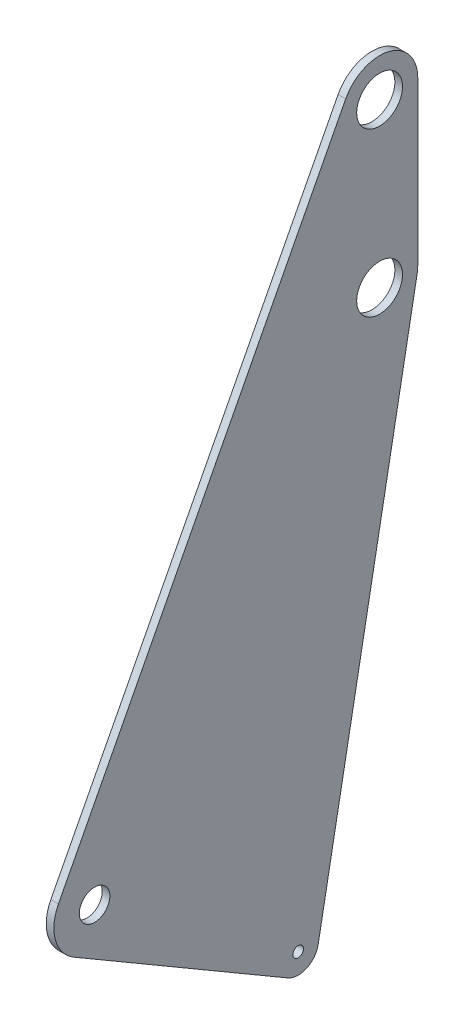
ISO-10303-21;
HEADER;
FILE_DESCRIPTION(('STEP AP214'),'2;1');
FILE_NAME('part.step','',(''),(''),'','','');
FILE_SCHEMA(('AUTOMOTIVE_DESIGN { 1 0 10303 214 1 1 1 1 }'));
ENDSEC;
DATA;
#1=APPLICATION_CONTEXT('core data for automotive mechanical design processes');
#2=APPLICATION_PROTOCOL_DEFINITION('international standard','automotive_design',2000,#1);
#3=PRODUCT_CONTEXT('',#1,'mechanical');
#4=PRODUCT('Part','Part','',(#3));
#5=PRODUCT_RELATED_PRODUCT_CATEGORY('part','',(#4));
#6=PRODUCT_DEFINITION_FORMATION('','',#4);
#7=PRODUCT_DEFINITION_CONTEXT('part definition',#1,'design');
#8=PRODUCT_DEFINITION('design','',#6,#7);
#9=PRODUCT_DEFINITION_SHAPE('','',#8);
#10=(LENGTH_UNIT() NAMED_UNIT(*) SI_UNIT(.MILLI.,.METRE.));
#11=(NAMED_UNIT(*) PLANE_ANGLE_UNIT() SI_UNIT($,.RADIAN.));
#12=(NAMED_UNIT(*) SI_UNIT($,.STERADIAN.) SOLID_ANGLE_UNIT());
#13=UNCERTAINTY_MEASURE_WITH_UNIT(LENGTH_MEASURE(1.E-05),#10,'distance_accuracy_value','');
#14=(GEOMETRIC_REPRESENTATION_CONTEXT(3) GLOBAL_UNCERTAINTY_ASSIGNED_CONTEXT((#13)) GLOBAL_UNIT_ASSIGNED_CONTEXT((#10,
#11,#12)) REPRESENTATION_CONTEXT('',''));
#15=CARTESIAN_POINT('',(0.,0.,0.));
#16=DIRECTION('',(0.,0.,1.));
#17=DIRECTION('',(1.,0.,0.));
#18=AXIS2_PLACEMENT_3D('',#15,#16,#17);
#19=CARTESIAN_POINT('',(0.,12.7,-152.4));
#20=DIRECTION('',(1.,0.,0.));
#21=DIRECTION('',(0.,0.,-1.));
#22=AXIS2_PLACEMENT_3D('',#19,#20,#21);
#23=PLANE('',#22);
#24=CARTESIAN_POINT('',(7.45058528761611E-10,12.7,-152.4));
#25=DIRECTION('',(-1.,0.,0.));
#26=DIRECTION('',(0.,0.,1.));
#27=AXIS2_PLACEMENT_3D('',#24,#25,#26);
#28=CIRCLE('',#27,3.3147);
#29=CARTESIAN_POINT('',(7.45058528761611E-10,12.7,-149.0853));
#30=VERTEX_POINT('',#29);
#31=EDGE_CURVE('E140',#30,#30,#28,.F.);
#32=ORIENTED_EDGE('',*,*,#31,.T.);
#33=EDGE_LOOP('',(#32));
#34=FACE_BOUND('',#33,.T.);
#35=CARTESIAN_POINT('',(7.45058528761611E-10,346.075,-203.2));
#36=DIRECTION('',(-1.,0.,0.));
#37=DIRECTION('',(0.,0.,1.));
#38=AXIS2_PLACEMENT_3D('',#35,#36,#37);
#39=CIRCLE('',#38,14.2875);
#40=CARTESIAN_POINT('',(7.45058528761611E-10,346.075,-188.9125));
#41=VERTEX_POINT('',#40);
#42=EDGE_CURVE('E100',#41,#41,#39,.F.);
#43=ORIENTED_EDGE('',*,*,#42,.T.);
#44=EDGE_LOOP('',(#43));
#45=FACE_BOUND('',#44,.T.);
#46=CARTESIAN_POINT('',(0.,101.6,-25.4));
#47=DIRECTION('',(-1.,0.,0.));
#48=DIRECTION('',(0.,0.,1.));
#49=AXIS2_PLACEMENT_3D('',#46,#47,#48);
#50=CIRCLE('',#49,9.525);
#51=CARTESIAN_POINT('',(0.,101.6,-15.875));
#52=VERTEX_POINT('',#51);
#53=EDGE_CURVE('E143',#52,#52,#50,.F.);
#54=ORIENTED_EDGE('',*,*,#53,.T.);
#55=EDGE_LOOP('',(#54));
#56=FACE_BOUND('',#55,.T.);
#57=CARTESIAN_POINT('',(7.45058528761611E-10,447.675,-203.2));
#58=DIRECTION('',(-1.,0.,0.));
#59=DIRECTION('',(0.,0.,1.));
#60=AXIS2_PLACEMENT_3D('',#57,#58,#59);
#61=CIRCLE('',#60,14.2875);
#62=CARTESIAN_POINT('',(7.45058528761611E-10,447.675,-188.9125));
#63=VERTEX_POINT('',#62);
#64=EDGE_CURVE('E103',#63,#63,#61,.F.);
#65=ORIENTED_EDGE('',*,*,#64,.T.);
#66=EDGE_LOOP('',(#65));
#67=FACE_BOUND('',#66,.T.);
#68=DIRECTION('',(0.,0.50442064043099,0.863458057757984));
#69=VECTOR('',#68,1.);
#70=CARTESIAN_POINT('',(0.,79.6681653329,-12.5877157331));
#71=LINE('',#70,#69);
#72=CARTESIAN_POINT('',(0.,1.73408266647434,-145.99385786639));
#73=VERTEX_POINT('',#72);
#74=CARTESIAN_POINT('',(3.72529264380805E-10,79.6681653329163,-12.5877157330721));
#75=VERTEX_POINT('',#74);
#76=EDGE_CURVE('E83',#73,#75,#71,.T.);
#77=ORIENTED_EDGE('',*,*,#76,.T.);
#78=CARTESIAN_POINT('',(7.45058528761611E-10,101.6,-25.4));
#79=DIRECTION('',(-1.,0.,0.));
#80=DIRECTION('',(0.,0.,1.));
#81=AXIS2_PLACEMENT_3D('',#78,#79,#80);
#82=CIRCLE('',#81,25.4);
#83=CARTESIAN_POINT('',(0.,113.299357351247,-2.85482229904441));
#84=VERTEX_POINT('',#83);
#85=EDGE_CURVE('E148',#84,#75,#82,.F.);
#86=ORIENTED_EDGE('',*,*,#85,.F.);
#87=DIRECTION('',(0.,0.887605421302147,-0.460604620119076));
#88=VECTOR('',#87,1.);
#89=CARTESIAN_POINT('',(0.,113.299357351,-2.85482229892));
#90=LINE('',#89,#88);
#91=CARTESIAN_POINT('',(0.,458.643147516216,-182.063895905269));
#92=VERTEX_POINT('',#91);
#93=EDGE_CURVE('E108',#84,#92,#90,.T.);
#94=ORIENTED_EDGE('',*,*,#93,.T.);
#95=CARTESIAN_POINT('',(0.,447.675,-203.2));
#96=DIRECTION('',(-1.,0.,0.));
#97=DIRECTION('',(0.,0.,1.));
#98=AXIS2_PLACEMENT_3D('',#95,#96,#97);
#99=CIRCLE('',#98,23.8125);
#100=CARTESIAN_POINT('',(0.,447.675,-227.0125));
#101=VERTEX_POINT('',#100);
#102=EDGE_CURVE('E116',#101,#92,#99,.F.);
#103=ORIENTED_EDGE('',*,*,#102,.F.);
#104=DIRECTION('',(0.,1.,0.));
#105=VECTOR('',#104,1.);
#106=CARTESIAN_POINT('',(0.,346.075,-227.0125));
#107=LINE('',#106,#105);
#108=CARTESIAN_POINT('',(0.,346.075,-227.0125));
#109=VERTEX_POINT('',#108);
#110=EDGE_CURVE('E113',#101,#109,#107,.F.);
#111=ORIENTED_EDGE('',*,*,#110,.T.);
#112=CARTESIAN_POINT('',(0.,346.075,-203.2));
#113=DIRECTION('',(-1.,0.,0.));
#114=DIRECTION('',(0.,0.,1.));
#115=AXIS2_PLACEMENT_3D('',#112,#113,#114);
#116=CIRCLE('',#115,23.8125);
#117=CARTESIAN_POINT('',(0.,341.714047226448,-226.609768199343));
#118=VERTEX_POINT('',#117);
#119=EDGE_CURVE('E118',#118,#109,#116,.F.);
#120=ORIENTED_EDGE('',*,*,#119,.F.);
#121=DIRECTION('',(0.,-0.983087378461124,0.183137124337023));
#122=VECTOR('',#121,1.);
#123=CARTESIAN_POINT('',(0.,10.3741585209,-164.885209706));
#124=LINE('',#123,#122);
#125=CARTESIAN_POINT('',(0.,10.374158521089,-164.885209706035));
#126=VERTEX_POINT('',#125);
#127=EDGE_CURVE('E86',#118,#126,#124,.T.);
#128=ORIENTED_EDGE('',*,*,#127,.T.);
#129=CARTESIAN_POINT('',(0.,12.7,-152.4));
#130=DIRECTION('',(-1.,0.,0.));
#131=DIRECTION('',(0.,0.,1.));
#132=AXIS2_PLACEMENT_3D('',#129,#130,#131);
#133=CIRCLE('',#132,12.7);
#134=EDGE_CURVE('E20',#73,#126,#133,.F.);
#135=ORIENTED_EDGE('',*,*,#134,.F.);
#136=EDGE_LOOP('',(#77,#86,#94,#103,#111,#120,#128,#135));
#137=FACE_BOUND('',#136,.T.);
#138=ADVANCED_FACE('F17',(#34,#45,#56,#67,#137),#23,.F.);
#139=CARTESIAN_POINT('',(4.7625,12.7,-152.4));
#140=DIRECTION('',(-1.,0.,0.));
#141=DIRECTION('',(0.,0.,1.));
#142=AXIS2_PLACEMENT_3D('',#139,#140,#141);
#143=CYLINDRICAL_SURFACE('',#142,12.7);
#144=CARTESIAN_POINT('',(4.7625,12.7,-152.4));
#145=DIRECTION('',(-1.,0.,0.));
#146=DIRECTION('',(0.,0.,1.));
#147=AXIS2_PLACEMENT_3D('',#144,#145,#146);
#148=CIRCLE('',#147,12.7);
#149=CARTESIAN_POINT('',(4.7625,1.73408266623929,-145.993857866226));
#150=VERTEX_POINT('',#149);
#151=CARTESIAN_POINT('',(4.7625,10.3741585210012,-164.88520970651));
#152=VERTEX_POINT('',#151);
#153=EDGE_CURVE('E94',#150,#152,#148,.F.);
#154=ORIENTED_EDGE('',*,*,#153,.F.);
#155=DIRECTION('',(1.,0.,0.));
#156=VECTOR('',#155,1.);
#157=CARTESIAN_POINT('',(4.7625,1.73408266653381,-145.993857866289));
#158=LINE('',#157,#156);
#159=EDGE_CURVE('E91',#150,#73,#158,.F.);
#160=ORIENTED_EDGE('',*,*,#159,.T.);
#161=ORIENTED_EDGE('',*,*,#134,.T.);
#162=DIRECTION('',(1.,0.,0.));
#163=VECTOR('',#162,1.);
#164=CARTESIAN_POINT('',(4.7625,10.3741585211767,-164.885209706052));
#165=LINE('',#164,#163);
#166=EDGE_CURVE('E89',#126,#152,#165,.T.);
#167=ORIENTED_EDGE('',*,*,#166,.T.);
#168=EDGE_LOOP('',(#154,#160,#161,#167));
#169=FACE_BOUND('',#168,.T.);
#170=ADVANCED_FACE('F92',(#169),#143,.T.);
#171=CARTESIAN_POINT('',(4.7625,10.3741585209,-164.885209706));
#172=DIRECTION('',(0.,0.183137124337023,0.983087378461124));
#173=DIRECTION('',(0.,-0.983087378461124,0.183137124337023));
#174=AXIS2_PLACEMENT_3D('',#171,#172,#173);
#175=PLANE('',#174);
#176=DIRECTION('',(-1.,0.,0.));
#177=VECTOR('',#176,1.);
#178=CARTESIAN_POINT('',(4.7625,341.714047226095,-226.609768199488));
#179=LINE('',#178,#177);
#180=CARTESIAN_POINT('',(4.7625,341.714047226363,-226.609768199803));
#181=VERTEX_POINT('',#180);
#182=EDGE_CURVE('E151',#181,#118,#179,.T.);
#183=ORIENTED_EDGE('',*,*,#182,.F.);
#184=DIRECTION('',(0.,0.98308737846114,-0.183137124336938));
#185=VECTOR('',#184,1.);
#186=CARTESIAN_POINT('',(4.7625,10.374158521,-164.885209707));
#187=LINE('',#186,#185);
#188=EDGE_CURVE('E138',#152,#181,#187,.T.);
#189=ORIENTED_EDGE('',*,*,#188,.F.);
#190=ORIENTED_EDGE('',*,*,#166,.F.);
#191=ORIENTED_EDGE('',*,*,#127,.F.);
#192=EDGE_LOOP('',(#183,#189,#190,#191));
#193=FACE_BOUND('',#192,.T.);
#194=ADVANCED_FACE('F171',(#193),#175,.F.);
#195=CARTESIAN_POINT('',(4.7625,346.075,-203.2));
#196=DIRECTION('',(-1.,0.,0.));
#197=DIRECTION('',(0.,0.,1.));
#198=AXIS2_PLACEMENT_3D('',#195,#196,#197);
#199=CYLINDRICAL_SURFACE('',#198,23.8125);
#200=CARTESIAN_POINT('',(4.7625,346.075,-203.2));
#201=DIRECTION('',(-1.,0.,0.));
#202=DIRECTION('',(0.,0.,1.));
#203=AXIS2_PLACEMENT_3D('',#200,#201,#202);
#204=CIRCLE('',#203,23.8125);
#205=CARTESIAN_POINT('',(4.7625,346.075,-227.0125000005));
#206=VERTEX_POINT('',#205);
#207=EDGE_CURVE('E135',#181,#206,#204,.F.);
#208=ORIENTED_EDGE('',*,*,#207,.F.);
#209=ORIENTED_EDGE('',*,*,#182,.T.);
#210=ORIENTED_EDGE('',*,*,#119,.T.);
#211=DIRECTION('',(1.,0.,0.));
#212=VECTOR('',#211,1.);
#213=CARTESIAN_POINT('',(4.7625,346.075,-227.0125));
#214=LINE('',#213,#212);
#215=EDGE_CURVE('E117',#109,#206,#214,.T.);
#216=ORIENTED_EDGE('',*,*,#215,.T.);
#217=EDGE_LOOP('',(#208,#209,#210,#216));
#218=FACE_BOUND('',#217,.T.);
#219=ADVANCED_FACE('F172',(#218),#199,.T.);
#220=CARTESIAN_POINT('',(4.7625,346.075,-227.0125));
#221=DIRECTION('',(0.,0.,1.));
#222=DIRECTION('',(1.,0.,0.));
#223=AXIS2_PLACEMENT_3D('',#220,#221,#222);
#224=PLANE('',#223);
#225=DIRECTION('',(-1.,0.,0.));
#226=VECTOR('',#225,1.);
#227=CARTESIAN_POINT('',(4.7625,447.675,-227.0125));
#228=LINE('',#227,#226);
#229=CARTESIAN_POINT('',(4.7625,447.675,-227.0125000005));
#230=VERTEX_POINT('',#229);
#231=EDGE_CURVE('E150',#230,#101,#228,.T.);
#232=ORIENTED_EDGE('',*,*,#231,.F.);
#233=DIRECTION('',(0.,1.,0.));
#234=VECTOR('',#233,1.);
#235=CARTESIAN_POINT('',(4.7625,12.7,-227.012500001));
#236=LINE('',#235,#234);
#237=EDGE_CURVE('E134',#206,#230,#236,.T.);
#238=ORIENTED_EDGE('',*,*,#237,.F.);
#239=ORIENTED_EDGE('',*,*,#215,.F.);
#240=ORIENTED_EDGE('',*,*,#110,.F.);
#241=EDGE_LOOP('',(#232,#238,#239,#240));
#242=FACE_BOUND('',#241,.T.);
#243=ADVANCED_FACE('F177',(#242),#224,.F.);
#244=CARTESIAN_POINT('',(4.7625,447.675,-203.2));
#245=DIRECTION('',(-1.,0.,0.));
#246=DIRECTION('',(0.,0.,1.));
#247=AXIS2_PLACEMENT_3D('',#244,#245,#246);
#248=CYLINDRICAL_SURFACE('',#247,23.8125);
#249=CARTESIAN_POINT('',(4.7625,447.675,-203.2));
#250=DIRECTION('',(-1.,0.,0.));
#251=DIRECTION('',(0.,0.,1.));
#252=AXIS2_PLACEMENT_3D('',#249,#250,#251);
#253=CIRCLE('',#252,23.8125);
#254=CARTESIAN_POINT('',(4.7625,458.643147516276,-182.063895905222));
#255=VERTEX_POINT('',#254);
#256=EDGE_CURVE('E131',#230,#255,#253,.F.);
#257=ORIENTED_EDGE('',*,*,#256,.F.);
#258=ORIENTED_EDGE('',*,*,#231,.T.);
#259=ORIENTED_EDGE('',*,*,#102,.T.);
#260=DIRECTION('',(1.,0.,0.));
#261=VECTOR('',#260,1.);
#262=CARTESIAN_POINT('',(4.7625,458.643147515936,-182.063895905124));
#263=LINE('',#262,#261);
#264=EDGE_CURVE('E112',#92,#255,#263,.T.);
#265=ORIENTED_EDGE('',*,*,#264,.T.);
#266=EDGE_LOOP('',(#257,#258,#259,#265));
#267=FACE_BOUND('',#266,.T.);
#268=ADVANCED_FACE('F181',(#267),#248,.T.);
#269=CARTESIAN_POINT('',(4.7625,113.299357351,-2.85482229892));
#270=DIRECTION('',(0.,-0.460604620119076,-0.887605421302147));
#271=DIRECTION('',(0.,0.887605421302147,-0.460604620119076));
#272=AXIS2_PLACEMENT_3D('',#269,#270,#271);
#273=PLANE('',#272);
#274=DIRECTION('',(-1.,0.,0.));
#275=VECTOR('',#274,1.);
#276=CARTESIAN_POINT('',(4.7625,113.299357351472,-2.85482229915764));
#277=LINE('',#276,#275);
#278=CARTESIAN_POINT('',(4.7625,113.299357351542,-2.85482229854796));
#279=VERTEX_POINT('',#278);
#280=EDGE_CURVE('E111',#279,#84,#277,.T.);
#281=ORIENTED_EDGE('',*,*,#280,.F.);
#282=DIRECTION('',(0.,-0.887605421300947,0.460604620121388));
#283=VECTOR('',#282,1.);
#284=CARTESIAN_POINT('',(4.7625,458.643147516,-182.063895905));
#285=LINE('',#284,#283);
#286=EDGE_CURVE('E130',#255,#279,#285,.T.);
#287=ORIENTED_EDGE('',*,*,#286,.F.);
#288=ORIENTED_EDGE('',*,*,#264,.F.);
#289=ORIENTED_EDGE('',*,*,#93,.F.);
#290=EDGE_LOOP('',(#281,#287,#288,#289));
#291=FACE_BOUND('',#290,.T.);
#292=ADVANCED_FACE('F185',(#291),#273,.F.);
#293=CARTESIAN_POINT('',(4.7625,101.6,-25.4));
#294=DIRECTION('',(-1.,0.,0.));
#295=DIRECTION('',(0.,0.,1.));
#296=AXIS2_PLACEMENT_3D('',#293,#294,#295);
#297=CYLINDRICAL_SURFACE('',#296,25.4);
#298=ORIENTED_EDGE('',*,*,#85,.T.);
#299=DIRECTION('',(1.,0.,0.));
#300=VECTOR('',#299,1.);
#301=CARTESIAN_POINT('',(4.7625,79.6681653329,-12.5877157331));
#302=LINE('',#301,#300);
#303=CARTESIAN_POINT('',(4.7625,79.66816533294,-12.5877157330315));
#304=VERTEX_POINT('',#303);
#305=EDGE_CURVE('E97',#75,#304,#302,.T.);
#306=ORIENTED_EDGE('',*,*,#305,.T.);
#307=CARTESIAN_POINT('',(4.7625,101.6,-25.4));
#308=DIRECTION('',(-1.,0.,0.));
#309=DIRECTION('',(0.,0.,1.));
#310=AXIS2_PLACEMENT_3D('',#307,#308,#309);
#311=CIRCLE('',#310,25.4);
#312=EDGE_CURVE('E35',#279,#304,#311,.F.);
#313=ORIENTED_EDGE('',*,*,#312,.F.);
#314=ORIENTED_EDGE('',*,*,#280,.T.);
#315=EDGE_LOOP('',(#298,#306,#313,#314));
#316=FACE_BOUND('',#315,.T.);
#317=ADVANCED_FACE('F187',(#316),#297,.T.);
#318=CARTESIAN_POINT('',(4.7625,79.6681653329,-12.5877157331));
#319=DIRECTION('',(0.,0.863458057757984,-0.50442064043099));
#320=DIRECTION('',(0.,0.50442064043099,0.863458057757984));
#321=AXIS2_PLACEMENT_3D('',#318,#319,#320);
#322=PLANE('',#321);
#323=ORIENTED_EDGE('',*,*,#159,.F.);
#324=DIRECTION('',(0.,-0.504420640434187,-0.863458057756116));
#325=VECTOR('',#324,1.);
#326=CARTESIAN_POINT('',(4.7625,79.6681653329,-12.5877157331));
#327=LINE('',#326,#325);
#328=EDGE_CURVE('E128',#304,#150,#327,.T.);
#329=ORIENTED_EDGE('',*,*,#328,.F.);
#330=ORIENTED_EDGE('',*,*,#305,.F.);
#331=ORIENTED_EDGE('',*,*,#76,.F.);
#332=EDGE_LOOP('',(#323,#329,#330,#331));
#333=FACE_BOUND('',#332,.T.);
#334=ADVANCED_FACE('F99',(#333),#322,.F.);
#335=CARTESIAN_POINT('',(4.7625,346.075,-203.2));
#336=DIRECTION('',(-1.,0.,0.));
#337=DIRECTION('',(0.,0.,1.));
#338=AXIS2_PLACEMENT_3D('',#335,#336,#337);
#339=CYLINDRICAL_SURFACE('',#338,14.2875);
#340=CARTESIAN_POINT('',(4.7625,346.075,-203.2));
#341=DIRECTION('',(-1.,0.,0.));
#342=DIRECTION('',(0.,0.,1.));
#343=AXIS2_PLACEMENT_3D('',#340,#341,#342);
#344=CIRCLE('',#343,14.2875);
#345=CARTESIAN_POINT('',(4.7625,346.075,-188.9125));
#346=VERTEX_POINT('',#345);
#347=EDGE_CURVE('E125',#346,#346,#344,.T.);
#348=ORIENTED_EDGE('',*,*,#347,.F.);
#349=EDGE_LOOP('',(#348));
#350=FACE_BOUND('',#349,.T.);
#351=ORIENTED_EDGE('',*,*,#42,.F.);
#352=EDGE_LOOP('',(#351));
#353=FACE_BOUND('',#352,.T.);
#354=ADVANCED_FACE('F195',(#350,#353),#339,.F.);
#355=CARTESIAN_POINT('',(4.7625,447.675,-203.2));
#356=DIRECTION('',(-1.,0.,0.));
#357=DIRECTION('',(0.,0.,1.));
#358=AXIS2_PLACEMENT_3D('',#355,#356,#357);
#359=CYLINDRICAL_SURFACE('',#358,14.2875);
#360=CARTESIAN_POINT('',(4.7625,447.675,-203.2));
#361=DIRECTION('',(-1.,0.,0.));
#362=DIRECTION('',(0.,0.,1.));
#363=AXIS2_PLACEMENT_3D('',#360,#361,#362);
#364=CIRCLE('',#363,14.2875);
#365=CARTESIAN_POINT('',(4.7625,447.675,-188.9125));
#366=VERTEX_POINT('',#365);
#367=EDGE_CURVE('E122',#366,#366,#364,.T.);
#368=ORIENTED_EDGE('',*,*,#367,.F.);
#369=EDGE_LOOP('',(#368));
#370=FACE_BOUND('',#369,.T.);
#371=ORIENTED_EDGE('',*,*,#64,.F.);
#372=EDGE_LOOP('',(#371));
#373=FACE_BOUND('',#372,.T.);
#374=ADVANCED_FACE('F212',(#370,#373),#359,.F.);
#375=CARTESIAN_POINT('',(4.7625,101.6,-25.4));
#376=DIRECTION('',(-1.,0.,0.));
#377=DIRECTION('',(0.,0.,1.));
#378=AXIS2_PLACEMENT_3D('',#375,#376,#377);
#379=CYLINDRICAL_SURFACE('',#378,9.525);
#380=CARTESIAN_POINT('',(4.7625,101.6,-25.4));
#381=DIRECTION('',(-1.,0.,0.));
#382=DIRECTION('',(0.,0.,1.));
#383=AXIS2_PLACEMENT_3D('',#380,#381,#382);
#384=CIRCLE('',#383,9.525);
#385=CARTESIAN_POINT('',(4.7625,101.6,-15.875));
#386=VERTEX_POINT('',#385);
#387=EDGE_CURVE('E26',#386,#386,#384,.T.);
#388=ORIENTED_EDGE('',*,*,#387,.F.);
#389=EDGE_LOOP('',(#388));
#390=FACE_BOUND('',#389,.T.);
#391=ORIENTED_EDGE('',*,*,#53,.F.);
#392=EDGE_LOOP('',(#391));
#393=FACE_BOUND('',#392,.T.);
#394=ADVANCED_FACE('F205',(#390,#393),#379,.F.);
#395=CARTESIAN_POINT('',(4.7625,12.7,-152.4));
#396=DIRECTION('',(-1.,0.,0.));
#397=DIRECTION('',(0.,0.,1.));
#398=AXIS2_PLACEMENT_3D('',#395,#396,#397);
#399=CYLINDRICAL_SURFACE('',#398,3.3147);
#400=CARTESIAN_POINT('',(4.7625,12.7,-152.4));
#401=DIRECTION('',(-1.,0.,0.));
#402=DIRECTION('',(0.,0.,1.));
#403=AXIS2_PLACEMENT_3D('',#400,#401,#402);
#404=CIRCLE('',#403,3.3147);
#405=CARTESIAN_POINT('',(4.7625,12.7,-149.0853));
#406=VERTEX_POINT('',#405);
#407=EDGE_CURVE('E11',#406,#406,#404,.T.);
#408=ORIENTED_EDGE('',*,*,#407,.F.);
#409=EDGE_LOOP('',(#408));
#410=FACE_BOUND('',#409,.T.);
#411=ORIENTED_EDGE('',*,*,#31,.F.);
#412=EDGE_LOOP('',(#411));
#413=FACE_BOUND('',#412,.T.);
#414=ADVANCED_FACE('F199',(#410,#413),#399,.F.);
#415=CARTESIAN_POINT('',(4.7625,12.7,-152.4));
#416=DIRECTION('',(1.,0.,0.));
#417=DIRECTION('',(0.,0.,-1.));
#418=AXIS2_PLACEMENT_3D('',#415,#416,#417);
#419=PLANE('',#418);
#420=ORIENTED_EDGE('',*,*,#407,.T.);
#421=EDGE_LOOP('',(#420));
#422=FACE_BOUND('',#421,.T.);
#423=ORIENTED_EDGE('',*,*,#387,.T.);
#424=EDGE_LOOP('',(#423));
#425=FACE_BOUND('',#424,.T.);
#426=ORIENTED_EDGE('',*,*,#367,.T.);
#427=EDGE_LOOP('',(#426));
#428=FACE_BOUND('',#427,.T.);
#429=ORIENTED_EDGE('',*,*,#347,.T.);
#430=EDGE_LOOP('',(#429));
#431=FACE_BOUND('',#430,.T.);
#432=ORIENTED_EDGE('',*,*,#312,.T.);
#433=ORIENTED_EDGE('',*,*,#328,.T.);
#434=ORIENTED_EDGE('',*,*,#153,.T.);
#435=ORIENTED_EDGE('',*,*,#188,.T.);
#436=ORIENTED_EDGE('',*,*,#207,.T.);
#437=ORIENTED_EDGE('',*,*,#237,.T.);
#438=ORIENTED_EDGE('',*,*,#256,.T.);
#439=ORIENTED_EDGE('',*,*,#286,.T.);
#440=EDGE_LOOP('',(#432,#433,#434,#435,#436,#437,#438,#439));
#441=FACE_BOUND('',#440,.T.);
#442=ADVANCED_FACE('F168',(#422,#425,#428,#431,#441),#419,.T.);
#443=CLOSED_SHELL('',(#138,#170,#194,#219,#243,#268,#292,#317,#334,#354,#374,#394,#414,#442));
#444=MANIFOLD_SOLID_BREP('B1',#443);
#445=ADVANCED_BREP_SHAPE_REPRESENTATION('',(#18,#444),#14);
#446=SHAPE_DEFINITION_REPRESENTATION(#9,#445);
ENDSEC;
END-ISO-10303-21;
